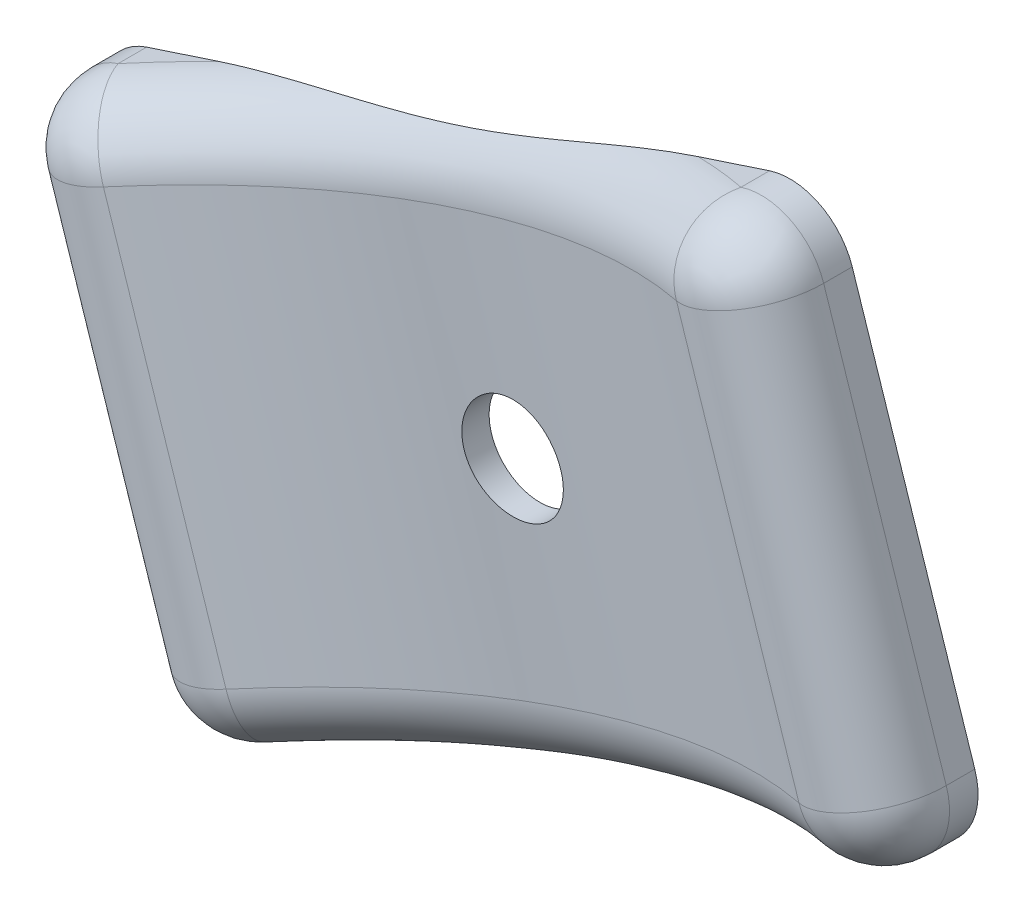
ISO-10303-21;
HEADER;
FILE_DESCRIPTION(('STEP AP214'),'2;1');
FILE_NAME('part.step','',(''),(''),'','','');
FILE_SCHEMA(('AUTOMOTIVE_DESIGN { 1 0 10303 214 1 1 1 1 }'));
ENDSEC;
DATA;
#1=APPLICATION_CONTEXT('core data for automotive mechanical design processes');
#2=APPLICATION_PROTOCOL_DEFINITION('international standard','automotive_design',2000,#1);
#3=PRODUCT_CONTEXT('',#1,'mechanical');
#4=PRODUCT('Part','Part','',(#3));
#5=PRODUCT_RELATED_PRODUCT_CATEGORY('part','',(#4));
#6=PRODUCT_DEFINITION_FORMATION('','',#4);
#7=PRODUCT_DEFINITION_CONTEXT('part definition',#1,'design');
#8=PRODUCT_DEFINITION('design','',#6,#7);
#9=PRODUCT_DEFINITION_SHAPE('','',#8);
#10=(LENGTH_UNIT() NAMED_UNIT(*) SI_UNIT(.MILLI.,.METRE.));
#11=(NAMED_UNIT(*) PLANE_ANGLE_UNIT() SI_UNIT($,.RADIAN.));
#12=(NAMED_UNIT(*) SI_UNIT($,.STERADIAN.) SOLID_ANGLE_UNIT());
#13=UNCERTAINTY_MEASURE_WITH_UNIT(LENGTH_MEASURE(1.E-05),#10,'distance_accuracy_value','');
#14=(GEOMETRIC_REPRESENTATION_CONTEXT(3) GLOBAL_UNCERTAINTY_ASSIGNED_CONTEXT((#13)) GLOBAL_UNIT_ASSIGNED_CONTEXT((#10,
#11,#12)) REPRESENTATION_CONTEXT('',''));
#15=CARTESIAN_POINT('',(0.,0.,0.));
#16=DIRECTION('',(0.,0.,1.));
#17=DIRECTION('',(1.,0.,0.));
#18=AXIS2_PLACEMENT_3D('',#15,#16,#17);
#19=CARTESIAN_POINT('',(-528.62847608422,562.94313302725,74.2702413816953));
#20=DIRECTION('',(-0.311692939950406,0.950182883020463,0.));
#21=DIRECTION('',(-0.950182883020463,-0.311692939950406,0.));
#22=AXIS2_PLACEMENT_3D('',#19,#20,#21);
#23=PLANE('',#22);
#24=DIRECTION('',(0.,0.,-1.));
#25=VECTOR('',#24,1.);
#26=CARTESIAN_POINT('',(-495.443338894726,573.829008955012,74.2702413816945));
#27=LINE('',#26,#25);
#28=CARTESIAN_POINT('',(-495.443338894733,573.82900895501,-5.27355936696949E-13));
#29=VERTEX_POINT('',#28);
#30=CARTESIAN_POINT('',(-495.443338894731,573.829008955012,1.38254680298319));
#31=VERTEX_POINT('',#30);
#32=EDGE_CURVE('E43',#29,#31,#27,.F.);
#33=ORIENTED_EDGE('',*,*,#32,.T.);
#34=CARTESIAN_POINT('',(-510.527492162676,568.880883533306,37.7567413816944));
#35=DIRECTION('',(-0.311692939950406,0.950182883020463,0.));
#36=DIRECTION('',(-0.950182883020463,-0.311692939950406,0.));
#37=AXIS2_PLACEMENT_3D('',#34,#35,#36);
#38=CIRCLE('',#37,39.6875);
#39=CARTESIAN_POINT('',(-498.908572239413,572.692292236459,-5.27355936696949E-13));
#40=VERTEX_POINT('',#39);
#41=EDGE_CURVE('E11',#31,#40,#38,.T.);
#42=ORIENTED_EDGE('',*,*,#41,.T.);
#43=DIRECTION('',(0.950182883020467,0.31169293995041,0.));
#44=VECTOR('',#43,1.);
#45=CARTESIAN_POINT('',(-528.628476084224,562.943133027249,1.55431223447522E-12));
#46=LINE('',#45,#44);
#47=EDGE_CURVE('E146',#40,#29,#46,.T.);
#48=ORIENTED_EDGE('',*,*,#47,.T.);
#49=EDGE_LOOP('',(#33,#42,#48));
#50=FACE_BOUND('',#49,.T.);
#51=ADVANCED_FACE('F34',(#50),#23,.F.);
#52=CARTESIAN_POINT('',(-536.545476758956,587.077778255965,74.2702413816951));
#53=DIRECTION('',(0.311692939950404,-0.950182883020462,0.));
#54=DIRECTION('',(0.950182883020462,0.311692939950404,0.));
#55=AXIS2_PLACEMENT_3D('',#52,#53,#54);
#56=PLANE('',#55);
#57=DIRECTION('',(-0.950182883020462,-0.311692939950404,0.));
#58=VECTOR('',#57,1.);
#59=CARTESIAN_POINT('',(-536.545476758966,587.077778255967,5.27355936696949E-13));
#60=LINE('',#59,#58);
#61=CARTESIAN_POINT('',(-503.36033956947,597.963654183732,0.));
#62=VERTEX_POINT('',#61);
#63=CARTESIAN_POINT('',(-506.825572914159,596.826937465177,4.9960036108132E-13));
#64=VERTEX_POINT('',#63);
#65=EDGE_CURVE('E147',#62,#64,#60,.T.);
#66=ORIENTED_EDGE('',*,*,#65,.T.);
#67=CARTESIAN_POINT('',(-518.444492837414,593.015528762026,37.7567413816942));
#68=DIRECTION('',(0.311692939950404,-0.950182883020462,0.));
#69=DIRECTION('',(0.950182883020462,0.311692939950404,0.));
#70=AXIS2_PLACEMENT_3D('',#67,#68,#69);
#71=CIRCLE('',#70,39.6875);
#72=CARTESIAN_POINT('',(-503.36033956947,597.963654183732,1.38254680298366));
#73=VERTEX_POINT('',#72);
#74=EDGE_CURVE('E156',#64,#73,#71,.T.);
#75=ORIENTED_EDGE('',*,*,#74,.T.);
#76=DIRECTION('',(0.,0.,-1.));
#77=VECTOR('',#76,1.);
#78=CARTESIAN_POINT('',(-503.360339569464,597.96365418373,74.2702413816962));
#79=LINE('',#78,#77);
#80=EDGE_CURVE('E352',#73,#62,#79,.T.);
#81=ORIENTED_EDGE('',*,*,#80,.T.);
#82=EDGE_LOOP('',(#66,#75,#81));
#83=FACE_BOUND('',#82,.T.);
#84=ADVANCED_FACE('F208',(#83),#56,.F.);
#85=CARTESIAN_POINT('',(0.,0.,0.));
#86=DIRECTION('',(0.,0.,-1.));
#87=DIRECTION('',(-1.00000000000001,0.,0.));
#88=AXIS2_PLACEMENT_3D('',#85,#86,#87);
#89=PLANE('',#88);
#90=CARTESIAN_POINT('',(-514.485992500057,580.948206147669,0.));
#91=DIRECTION('',(0.,0.,-1.));
#92=DIRECTION('',(-1.00000000000001,0.,0.));
#93=AXIS2_PLACEMENT_3D('',#90,#91,#92);
#94=CIRCLE('',#93,2.45744999999997);
#95=CARTESIAN_POINT('',(-516.943442500057,580.948206147669,0.));
#96=VERTEX_POINT('',#95);
#97=EDGE_CURVE('E270',#96,#96,#94,.T.);
#98=ORIENTED_EDGE('',*,*,#97,.F.);
#99=EDGE_LOOP('',(#98));
#100=FACE_BOUND('',#99,.T.);
#101=CARTESIAN_POINT('',(-530.063412760688,589.204120058872,1.69309011255336E-12));
#102=VERTEX_POINT('',#101);
#103=CARTESIAN_POINT('',(-533.528646105373,588.06740334031,5.27355936696949E-13));
#104=VERTEX_POINT('',#103);
#105=EDGE_CURVE('E278',#102,#104,#60,.T.);
#106=ORIENTED_EDGE('',*,*,#105,.F.);
#107=CARTESIAN_POINT('',(-530.063412760688,589.204120058872,1.69309011255336E-12));
#108=CARTESIAN_POINT('',(-529.811419203469,589.28676405944,6.0595892845147E-13));
#109=CARTESIAN_POINT('',(-529.55847474358,589.366438377945,1.61887063631748E-13));
#110=CARTESIAN_POINT('',(-529.051089031499,589.520739870902,-1.6186285121665E-13));
#111=CARTESIAN_POINT('',(-528.796648008843,589.59536779848,0.));
#112=CARTESIAN_POINT('',(-528.286779499595,589.740441434673,0.));
#113=CARTESIAN_POINT('',(-528.031352840859,589.810890072637,0.));
#114=CARTESIAN_POINT('',(-527.519605430863,589.94849307235,0.));
#115=CARTESIAN_POINT('',(-527.263284643548,590.015647299575,0.));
#116=CARTESIAN_POINT('',(-526.493126826157,590.213432288535,0.));
#117=CARTESIAN_POINT('',(-525.978333471018,590.340318969917,-2.93010217297221E-13));
#118=CARTESIAN_POINT('',(-524.947716549418,590.590296417725,2.93083988407288E-13));
#119=CARTESIAN_POINT('',(-524.431892756213,590.713386220418,1.12677005579328E-12));
#120=CARTESIAN_POINT('',(-523.254654412827,590.996989692707,1.34249259460469E-12));
#121=CARTESIAN_POINT('',(-522.593404552662,591.158224045594,2.46220362550343E-13));
#122=CARTESIAN_POINT('',(-521.604550157556,591.411729553421,-1.2308911635631E-13));
#123=CARTESIAN_POINT('',(-521.27546346644,591.498165821322,0.));
#124=CARTESIAN_POINT('',(-520.618672225304,591.67615125562,0.));
#125=CARTESIAN_POINT('',(-520.290967667433,591.767700392934,0.));
#126=CARTESIAN_POINT('',(-519.637374558129,591.956855303768,0.));
#127=CARTESIAN_POINT('',(-519.311485665971,592.054459896139,0.));
#128=CARTESIAN_POINT('',(-518.66176422105,592.256293457673,0.));
#129=CARTESIAN_POINT('',(-518.337931661631,592.36052240538,0.));
#130=CARTESIAN_POINT('',(-517.692500883797,592.57569059961,0.));
#131=CARTESIAN_POINT('',(-517.370902686805,592.686629910371,-1.58268218568464E-13));
#132=CARTESIAN_POINT('',(-516.729957411634,592.914823260577,1.5826895769808E-13));
#133=CARTESIAN_POINT('',(-516.410610344203,593.03207733015,5.90081560361208E-13));
#134=CARTESIAN_POINT('',(-515.704518179709,593.298296812364,6.97217452041519E-13));
#135=CARTESIAN_POINT('',(-515.318277601291,593.44859733588,1.86833486482486E-13));
#136=CARTESIAN_POINT('',(-514.548242459317,593.7553187587,-1.86836717686535E-13));
#137=CARTESIAN_POINT('',(-514.164447938427,593.911739764427,0.));
#138=CARTESIAN_POINT('',(-513.398314540719,594.228252991844,0.));
#139=CARTESIAN_POINT('',(-513.015975900963,594.388345783912,0.));
#140=CARTESIAN_POINT('',(-512.251712954135,594.709539161855,0.));
#141=CARTESIAN_POINT('',(-511.869788658693,594.870639775199,0.));
#142=CARTESIAN_POINT('',(-511.103504660287,595.191843463879,0.));
#143=CARTESIAN_POINT('',(-510.719141708106,595.351938846712,0.));
#144=CARTESIAN_POINT('',(-509.948578936939,595.667550585268,0.));
#145=CARTESIAN_POINT('',(-509.562379324668,595.823067442769,0.));
#146=CARTESIAN_POINT('',(-508.786890668311,596.126603271921,0.));
#147=CARTESIAN_POINT('',(-508.397600801916,596.274620164825,0.));
#148=CARTESIAN_POINT('',(-507.810613747059,596.488525286932,0.));
#149=CARTESIAN_POINT('',(-507.614402526421,596.558487008407,0.));
#150=CARTESIAN_POINT('',(-507.2208559766,596.695223130425,0.));
#151=CARTESIAN_POINT('',(-507.023520556578,596.761997269188,1.8414586612374E-13));
#152=CARTESIAN_POINT('',(-506.825572914158,596.826937465177,4.9960036108132E-13));
#153=B_SPLINE_CURVE_WITH_KNOTS('',3,(#107,#108,#109,#110,#111,#112,#113,#114,#115,#116,#117,
#118,#119,#120,#121,#122,#123,#124,#125,#126,#127,#128,#129,#130,#131,#132,#133,#134,#135,#136,
#137,#138,#139,#140,#141,#142,#143,#144,#145,#146,#147,#148,#149,#150,#151,#152),.UNSPECIFIED.,
.F.,.F.,(4,2,2,2,2,2,2,2,2,2,2,2,2,2,2,2,2,2,2,2,2,2,4),(0.,0.795548733611856,1.59097847593355,
2.38584393278886,3.18074182012739,4.77128195669194,6.3622225408555,8.40399702817783,
9.42470953580555,10.4454162380577,11.465924468109,12.4864293929644,13.5069440885456,
14.527463653473,15.7707493084118,17.0140565909677,18.25755833595,19.5010941237146,
20.7501959473358,21.9991603635233,23.2484690792019,23.8733773206907,24.4983367945743),.UNSPECIFIED.);
#154=EDGE_CURVE('E169',#102,#64,#153,.T.);
#155=ORIENTED_EDGE('',*,*,#154,.T.);
#156=ORIENTED_EDGE('',*,*,#65,.F.);
#157=CARTESIAN_POINT('',(-502.37071448513,594.946823530142,0.));
#158=DIRECTION('',(0.,0.,-1.));
#159=DIRECTION('',(-1.00000000000001,0.,0.));
#160=AXIS2_PLACEMENT_3D('',#157,#158,#159);
#161=CIRCLE('',#160,3.175);
#162=CARTESIAN_POINT('',(-499.35388383154,595.936448614483,0.));
#163=VERTEX_POINT('',#162);
#164=EDGE_CURVE('E152',#62,#163,#161,.T.);
#165=ORIENTED_EDGE('',*,*,#164,.T.);
#166=DIRECTION('',(-0.311692939950411,0.950182883020467,0.));
#167=VECTOR('',#166,1.);
#168=CARTESIAN_POINT('',(-500.343508915884,598.953279268079,0.));
#169=LINE('',#168,#167);
#170=CARTESIAN_POINT('',(-493.416133325488,577.83546469295,-5.27355936696949E-13));
#171=VERTEX_POINT('',#170);
#172=EDGE_CURVE('E227',#171,#163,#169,.T.);
#173=ORIENTED_EDGE('',*,*,#172,.F.);
#174=CARTESIAN_POINT('',(-496.432963979074,576.845839608609,-5.27355936696949E-13));
#175=DIRECTION('',(0.,0.,-1.));
#176=DIRECTION('',(-1.00000000000001,0.,0.));
#177=AXIS2_PLACEMENT_3D('',#174,#175,#176);
#178=CIRCLE('',#177,3.175);
#179=EDGE_CURVE('E154',#171,#29,#178,.T.);
#180=ORIENTED_EDGE('',*,*,#179,.T.);
#181=ORIENTED_EDGE('',*,*,#47,.F.);
#182=CARTESIAN_POINT('',(-498.908572239413,572.692292236459,-4.71844785465692E-13));
#183=CARTESIAN_POINT('',(-499.16056579663,572.609648235885,-1.69453568996889E-13));
#184=CARTESIAN_POINT('',(-499.413510256519,572.529973917378,0.));
#185=CARTESIAN_POINT('',(-499.9208959686,572.375672424418,0.));
#186=CARTESIAN_POINT('',(-500.175336991256,572.301044496841,0.));
#187=CARTESIAN_POINT('',(-500.685205500506,572.155970860648,0.));
#188=CARTESIAN_POINT('',(-500.940632159242,572.085522222684,0.));
#189=CARTESIAN_POINT('',(-501.452379569239,571.947919222971,0.));
#190=CARTESIAN_POINT('',(-501.708700356554,571.880764995745,0.));
#191=CARTESIAN_POINT('',(-502.478858173946,571.682980006786,0.));
#192=CARTESIAN_POINT('',(-502.993651529085,571.556093325403,0.));
#193=CARTESIAN_POINT('',(-504.024268450687,571.306115877596,0.));
#194=CARTESIAN_POINT('',(-504.540092243893,571.183026074905,0.));
#195=CARTESIAN_POINT('',(-505.71733058728,570.899422602616,0.));
#196=CARTESIAN_POINT('',(-506.378580447445,570.738188249727,0.));
#197=CARTESIAN_POINT('',(-507.36743484255,570.484682741899,0.));
#198=CARTESIAN_POINT('',(-507.696521533666,570.398246473997,0.));
#199=CARTESIAN_POINT('',(-508.353312774803,570.220261039699,0.));
#200=CARTESIAN_POINT('',(-508.681017332674,570.128711902386,0.));
#201=CARTESIAN_POINT('',(-509.334610441978,569.939556991551,0.));
#202=CARTESIAN_POINT('',(-509.660499334135,569.841952399179,0.));
#203=CARTESIAN_POINT('',(-510.310220779056,569.640118837646,0.));
#204=CARTESIAN_POINT('',(-510.634053338476,569.53588988994,0.));
#205=CARTESIAN_POINT('',(-511.279484116309,569.320721695708,0.));
#206=CARTESIAN_POINT('',(-511.6010823133,569.209782384944,0.));
#207=CARTESIAN_POINT('',(-512.242027588474,568.981589034744,0.));
#208=CARTESIAN_POINT('',(-512.561374655908,568.864334965179,0.));
#209=CARTESIAN_POINT('',(-513.267466820402,568.598115482967,0.));
#210=CARTESIAN_POINT('',(-513.653707398815,568.447814959442,0.));
#211=CARTESIAN_POINT('',(-514.423742540786,568.141093536614,0.));
#212=CARTESIAN_POINT('',(-514.807537061677,567.98467253089,0.));
#213=CARTESIAN_POINT('',(-515.573670459385,567.668159303475,0.));
#214=CARTESIAN_POINT('',(-515.956009099141,567.508066511406,0.));
#215=CARTESIAN_POINT('',(-516.720272045968,567.186873133463,0.));
#216=CARTESIAN_POINT('',(-517.10219634141,567.025772520119,0.));
#217=CARTESIAN_POINT('',(-517.868480339817,566.704568831439,0.));
#218=CARTESIAN_POINT('',(-518.252843291997,566.544473448607,0.));
#219=CARTESIAN_POINT('',(-519.023406063164,566.228861710051,0.));
#220=CARTESIAN_POINT('',(-519.409605675435,566.073344852549,0.));
#221=CARTESIAN_POINT('',(-520.185094331792,565.769809023398,0.));
#222=CARTESIAN_POINT('',(-520.574384198187,565.621792130495,0.));
#223=CARTESIAN_POINT('',(-521.161371253044,565.407887008387,0.));
#224=CARTESIAN_POINT('',(-521.357582473682,565.337925286911,-1.03646438541255E-13));
#225=CARTESIAN_POINT('',(-521.751129023503,565.201189164896,1.03654936072903E-13));
#226=CARTESIAN_POINT('',(-521.948464443527,565.134415026136,3.78470736313441E-13));
#227=CARTESIAN_POINT('',(-522.146412085949,565.069474830153,1.02695629777827E-12));
#228=B_SPLINE_CURVE_WITH_KNOTS('',3,(#182,#183,#184,#185,#186,#187,#188,#189,#190,#191,#192,
#193,#194,#195,#196,#197,#198,#199,#200,#201,#202,#203,#204,#205,#206,#207,#208,#209,#210,#211,
#212,#213,#214,#215,#216,#217,#218,#219,#220,#221,#222,#223,#224,#225,#226,#227),.UNSPECIFIED.,
.F.,.F.,(4,2,2,2,2,2,2,2,2,2,2,2,2,2,2,2,2,2,2,2,2,2,4),(0.,0.795548733613184,1.59097847593613,
2.38584393279246,3.18074182013202,4.77128195669859,6.36222254086414,8.40399702818682,
9.42470953581481,10.4454162380672,11.4659244681184,12.486429392974,13.506944088555,
14.5274636534823,15.7707493084202,17.0140565909754,18.2575583359573,19.5010941237214,
20.7501959473422,21.9991603635297,23.248469079208,23.8733773206969,24.4983367945809),.UNSPECIFIED.);
#229=CARTESIAN_POINT('',(-522.146412085949,565.069474830153,1.02695629777827E-12));
#230=VERTEX_POINT('',#229);
#231=EDGE_CURVE('E161',#40,#230,#228,.T.);
#232=ORIENTED_EDGE('',*,*,#231,.T.);
#233=CARTESIAN_POINT('',(-525.61164543063,563.932758111589,1.22124532708767E-12));
#234=VERTEX_POINT('',#233);
#235=EDGE_CURVE('E225',#234,#230,#46,.T.);
#236=ORIENTED_EDGE('',*,*,#235,.F.);
#237=CARTESIAN_POINT('',(-526.601270514974,566.949588765178,1.22124532708767E-12));
#238=DIRECTION('',(0.,0.,-1.));
#239=DIRECTION('',(-1.00000000000001,0.,0.));
#240=AXIS2_PLACEMENT_3D('',#237,#238,#239);
#241=CIRCLE('',#240,3.175);
#242=CARTESIAN_POINT('',(-529.618101168569,565.959963680835,1.55431223447522E-12));
#243=VERTEX_POINT('',#242);
#244=EDGE_CURVE('E145',#234,#243,#241,.T.);
#245=ORIENTED_EDGE('',*,*,#244,.T.);
#246=DIRECTION('',(0.311692939950403,-0.950182883020462,0.));
#247=VECTOR('',#246,1.);
#248=CARTESIAN_POINT('',(-536.545476758966,587.077778255967,5.27355936696949E-13));
#249=LINE('',#248,#247);
#250=CARTESIAN_POINT('',(-535.555851674623,584.060947602378,5.27355936696949E-13));
#251=VERTEX_POINT('',#250);
#252=EDGE_CURVE('E129',#251,#243,#249,.T.);
#253=ORIENTED_EDGE('',*,*,#252,.F.);
#254=CARTESIAN_POINT('',(-532.539021021026,585.050572686724,5.27355936696949E-13));
#255=DIRECTION('',(0.,0.,-1.));
#256=DIRECTION('',(-1.00000000000001,0.,0.));
#257=AXIS2_PLACEMENT_3D('',#254,#255,#256);
#258=CIRCLE('',#257,3.175);
#259=EDGE_CURVE('E141',#251,#104,#258,.T.);
#260=ORIENTED_EDGE('',*,*,#259,.T.);
#261=EDGE_LOOP('',(#106,#155,#156,#165,#173,#180,#181,#232,#236,#245,#253,#260));
#262=FACE_BOUND('',#261,.T.);
#263=ADVANCED_FACE('F140',(#100,#262),#89,.T.);
#264=CARTESIAN_POINT('',(-500.343508915881,598.953279268078,74.2702413816962));
#265=DIRECTION('',(-0.950182883020467,-0.311692939950411,0.));
#266=DIRECTION('',(0.311692939950411,-0.950182883020467,0.));
#267=AXIS2_PLACEMENT_3D('',#264,#265,#266);
#268=PLANE('',#267);
#269=DIRECTION('',(-0.311692939950411,0.950182883020467,0.));
#270=VECTOR('',#269,1.);
#271=CARTESIAN_POINT('',(-500.343508915884,598.953279268079,1.38254680298386));
#272=LINE('',#271,#270);
#273=CARTESIAN_POINT('',(-499.353883831537,595.936448614483,1.38254680298386));
#274=VERTEX_POINT('',#273);
#275=CARTESIAN_POINT('',(-493.416133325486,577.83546469295,1.38254680298336));
#276=VERTEX_POINT('',#275);
#277=EDGE_CURVE('E361',#274,#276,#272,.F.);
#278=ORIENTED_EDGE('',*,*,#277,.T.);
#279=DIRECTION('',(0.,0.,-1.));
#280=VECTOR('',#279,1.);
#281=CARTESIAN_POINT('',(-493.416133325481,577.835464692952,74.2702413816945));
#282=LINE('',#281,#280);
#283=EDGE_CURVE('E239',#276,#171,#282,.T.);
#284=ORIENTED_EDGE('',*,*,#283,.T.);
#285=ORIENTED_EDGE('',*,*,#172,.T.);
#286=DIRECTION('',(0.,0.,-1.));
#287=VECTOR('',#286,1.);
#288=CARTESIAN_POINT('',(-499.353883831535,595.936448614484,74.2702413816962));
#289=LINE('',#288,#287);
#290=EDGE_CURVE('E363',#163,#274,#289,.F.);
#291=ORIENTED_EDGE('',*,*,#290,.T.);
#292=EDGE_LOOP('',(#278,#284,#285,#291));
#293=FACE_BOUND('',#292,.T.);
#294=ADVANCED_FACE('F219',(#293),#268,.F.);
#295=ORIENTED_EDGE('',*,*,#235,.T.);
#296=CARTESIAN_POINT('',(-510.527492162676,568.880883533306,37.7567413816944));
#297=DIRECTION('',(-0.311692939950406,0.950182883020463,0.));
#298=DIRECTION('',(-0.950182883020463,-0.311692939950406,0.));
#299=AXIS2_PLACEMENT_3D('',#296,#297,#298);
#300=CIRCLE('',#299,39.6875);
#301=CARTESIAN_POINT('',(-525.611645430629,563.932758111589,1.38254680298616));
#302=VERTEX_POINT('',#301);
#303=EDGE_CURVE('E57',#230,#302,#300,.T.);
#304=ORIENTED_EDGE('',*,*,#303,.T.);
#305=DIRECTION('',(0.,0.,-1.));
#306=VECTOR('',#305,1.);
#307=CARTESIAN_POINT('',(-525.611645430627,563.932758111586,74.2702413816953));
#308=LINE('',#307,#306);
#309=EDGE_CURVE('E226',#302,#234,#308,.T.);
#310=ORIENTED_EDGE('',*,*,#309,.T.);
#311=EDGE_LOOP('',(#295,#304,#310));
#312=FACE_BOUND('',#311,.T.);
#313=ADVANCED_FACE('F210',(#312),#23,.F.);
#314=CARTESIAN_POINT('',(-536.545476758956,587.077778255965,74.2702413816951));
#315=DIRECTION('',(0.950182883020462,0.311692939950403,0.));
#316=DIRECTION('',(-0.311692939950403,0.950182883020462,0.));
#317=AXIS2_PLACEMENT_3D('',#314,#315,#316);
#318=PLANE('',#317);
#319=DIRECTION('',(-0.311692939950403,0.950182883020462,0.));
#320=VECTOR('',#319,1.);
#321=CARTESIAN_POINT('',(-536.545476758967,587.07777825597,1.38254680298569));
#322=LINE('',#321,#320);
#323=CARTESIAN_POINT('',(-529.618101168569,565.959963680835,1.38254680298672));
#324=VERTEX_POINT('',#323);
#325=CARTESIAN_POINT('',(-535.555851674623,584.060947602378,1.38254680298569));
#326=VERTEX_POINT('',#325);
#327=EDGE_CURVE('E132',#324,#326,#322,.T.);
#328=ORIENTED_EDGE('',*,*,#327,.T.);
#329=DIRECTION('',(0.,0.,-1.));
#330=VECTOR('',#329,1.);
#331=CARTESIAN_POINT('',(-535.55585167462,584.060947602378,74.2702413816951));
#332=LINE('',#331,#330);
#333=EDGE_CURVE('E126',#326,#251,#332,.T.);
#334=ORIENTED_EDGE('',*,*,#333,.T.);
#335=ORIENTED_EDGE('',*,*,#252,.T.);
#336=DIRECTION('',(0.,0.,-1.));
#337=VECTOR('',#336,1.);
#338=CARTESIAN_POINT('',(-529.618101168561,565.959963680835,74.2702413816953));
#339=LINE('',#338,#337);
#340=EDGE_CURVE('E283',#243,#324,#339,.F.);
#341=ORIENTED_EDGE('',*,*,#340,.T.);
#342=EDGE_LOOP('',(#328,#334,#335,#341));
#343=FACE_BOUND('',#342,.T.);
#344=ADVANCED_FACE('F128',(#343),#318,.F.);
#345=DIRECTION('',(0.,0.,-1.));
#346=VECTOR('',#345,1.);
#347=CARTESIAN_POINT('',(-533.528646105369,588.067403340309,74.2702413816935));
#348=LINE('',#347,#346);
#349=CARTESIAN_POINT('',(-533.528646105371,588.067403340309,1.38254680298552));
#350=VERTEX_POINT('',#349);
#351=EDGE_CURVE('E151',#104,#350,#348,.F.);
#352=ORIENTED_EDGE('',*,*,#351,.T.);
#353=CARTESIAN_POINT('',(-518.444492837414,593.015528762026,37.7567413816942));
#354=DIRECTION('',(0.311692939950404,-0.950182883020462,0.));
#355=DIRECTION('',(0.950182883020462,0.311692939950404,0.));
#356=AXIS2_PLACEMENT_3D('',#353,#354,#355);
#357=CIRCLE('',#356,39.6875);
#358=EDGE_CURVE('E319',#350,#102,#357,.T.);
#359=ORIENTED_EDGE('',*,*,#358,.T.);
#360=ORIENTED_EDGE('',*,*,#105,.T.);
#361=EDGE_LOOP('',(#352,#359,#360));
#362=FACE_BOUND('',#361,.T.);
#363=ADVANCED_FACE('F216',(#362),#56,.F.);
#364=CARTESIAN_POINT('',(-443.232986427391,363.736399089187,37.7567413816977));
#365=DIRECTION('',(-0.311692939950405,0.950182883020465,0.));
#366=DIRECTION('',(0.950182883020465,0.311692939950405,0.));
#367=AXIS2_PLACEMENT_3D('',#364,#365,#366);
#368=CYLINDRICAL_SURFACE('',#367,36.5125);
#369=CARTESIAN_POINT('',(-517.454867753075,589.998698108429,37.7567413816945));
#370=DIRECTION('',(0.311692939950404,-0.950182883020462,0.));
#371=DIRECTION('',(0.950182883020462,0.311692939950404,0.));
#372=AXIS2_PLACEMENT_3D('',#369,#370,#371);
#373=CIRCLE('',#372,36.5125);
#374=CARTESIAN_POINT('',(-503.577446746568,594.550973496411,4.29248236928076));
#375=VERTEX_POINT('',#374);
#376=CARTESIAN_POINT('',(-531.332288759591,585.446422720454,4.29248236928112));
#377=VERTEX_POINT('',#376);
#378=EDGE_CURVE('E307',#375,#377,#373,.F.);
#379=ORIENTED_EDGE('',*,*,#378,.T.);
#380=DIRECTION('',(-0.311692939950405,0.950182883020465,0.));
#381=VECTOR('',#380,1.);
#382=CARTESIAN_POINT('',(-457.110407433903,359.184123701211,4.29248236928273));
#383=LINE('',#382,#381);
#384=CARTESIAN_POINT('',(-525.394538253542,567.345438798919,4.29248236928098));
#385=VERTEX_POINT('',#384);
#386=EDGE_CURVE('E310',#377,#385,#383,.F.);
#387=ORIENTED_EDGE('',*,*,#386,.T.);
#388=CARTESIAN_POINT('',(-511.517117247018,571.897714186894,37.7567413816944));
#389=DIRECTION('',(-0.311692939950406,0.950182883020463,0.));
#390=DIRECTION('',(-0.950182883020463,-0.311692939950406,0.));
#391=AXIS2_PLACEMENT_3D('',#388,#389,#390);
#392=CIRCLE('',#391,36.5125);
#393=CARTESIAN_POINT('',(-497.63969624051,576.449989574865,4.29248236928123));
#394=VERTEX_POINT('',#393);
#395=EDGE_CURVE('E136',#385,#394,#392,.F.);
#396=ORIENTED_EDGE('',*,*,#395,.T.);
#397=DIRECTION('',(-0.311692939950405,0.950182883020465,0.));
#398=VECTOR('',#397,1.);
#399=CARTESIAN_POINT('',(-429.355565420878,368.288674477166,4.29248236928112));
#400=LINE('',#399,#398);
#401=EDGE_CURVE('E312',#394,#375,#400,.T.);
#402=ORIENTED_EDGE('',*,*,#401,.T.);
#403=EDGE_LOOP('',(#379,#387,#396,#402));
#404=FACE_BOUND('',#403,.T.);
#405=CARTESIAN_POINT('',(-516.943442500052,580.948206147666,1.31898204463818));
#406=CARTESIAN_POINT('',(-516.943436462238,581.086280128444,1.31622337745073));
#407=CARTESIAN_POINT('',(-516.931766955246,581.224438197499,1.31282615127622));
#408=CARTESIAN_POINT('',(-516.885391367775,581.496921099854,1.30513494053353));
#409=CARTESIAN_POINT('',(-516.850658092104,581.631241212452,1.30083990142821));
#410=CARTESIAN_POINT('',(-516.759153346013,581.892072418116,1.29184304621809));
#411=CARTESIAN_POINT('',(-516.702393323885,582.018587528269,1.2871414424082));
#412=CARTESIAN_POINT('',(-516.568454515422,582.260264755703,1.2778602910636));
#413=CARTESIAN_POINT('',(-516.491280635176,582.375429591695,1.27328071449262));
#414=CARTESIAN_POINT('',(-516.318616196164,582.591271744558,1.26475430325269));
#415=CARTESIAN_POINT('',(-516.223111502348,582.691937775731,1.26080796121628));
#416=CARTESIAN_POINT('',(-516.016521206682,582.875812213203,1.2539971715096));
#417=CARTESIAN_POINT('',(-515.905435172489,582.959020134922,1.2511327538682));
#418=CARTESIAN_POINT('',(-515.671009303191,583.105489195054,1.24681251412389));
#419=CARTESIAN_POINT('',(-515.547687385129,583.1687789489,1.24535466499239));
#420=CARTESIAN_POINT('',(-515.292164358795,583.273765310798,1.24400474561387));
#421=CARTESIAN_POINT('',(-515.159963368459,583.315462205588,1.24411265457409));
#422=CARTESIAN_POINT('',(-514.890679866993,583.376024487019,1.24588048542796));
#423=CARTESIAN_POINT('',(-514.753606067743,583.394928699628,1.24753775949432));
#424=CARTESIAN_POINT('',(-514.478252474929,583.409508427745,1.25221429954704));
#425=CARTESIAN_POINT('',(-514.339972677945,583.405183877352,1.25523356939733));
#426=CARTESIAN_POINT('',(-514.066025898861,583.373430931947,1.26229776166107));
#427=CARTESIAN_POINT('',(-513.930360723454,583.345987108566,1.26634336772731));
#428=CARTESIAN_POINT('',(-513.665563056324,583.268761496097,1.27500546665702));
#429=CARTESIAN_POINT('',(-513.536430660682,583.218979378572,1.27962196791353));
#430=CARTESIAN_POINT('',(-513.288084313322,583.098362069357,1.28891755078248));
#431=CARTESIAN_POINT('',(-513.168890773009,583.027484854767,1.29359673933461));
#432=CARTESIAN_POINT('',(-512.944083459417,582.866714258328,1.30248130506079));
#433=CARTESIAN_POINT('',(-512.838469699996,582.776820857072,1.30668668175127));
#434=CARTESIAN_POINT('',(-512.643797907115,582.580532715978,1.31414944322208));
#435=CARTESIAN_POINT('',(-512.554743583247,582.474134288503,1.31740661568087));
#436=CARTESIAN_POINT('',(-512.395763214968,582.247867340347,1.3226024059001));
#437=CARTESIAN_POINT('',(-512.325836918233,582.127998997381,1.32454104105427));
#438=CARTESIAN_POINT('',(-512.207228241756,581.878444750944,1.32687723697683));
#439=CARTESIAN_POINT('',(-512.158505421905,581.748778094761,1.3272777428492));
#440=CARTESIAN_POINT('',(-512.08349727712,581.48311517812,1.32650043684738));
#441=CARTESIAN_POINT('',(-512.057211793439,581.347118962452,1.32532263614002));
#442=CARTESIAN_POINT('',(-512.027834473832,581.072812054894,1.32152428174242));
#443=CARTESIAN_POINT('',(-512.024717990961,580.934503979417,1.31890526439112));
#444=CARTESIAN_POINT('',(-512.041688764264,580.659345771512,1.31252112067334));
#445=CARTESIAN_POINT('',(-512.061776252284,580.522495653665,1.30875598285545));
#446=CARTESIAN_POINT('',(-512.1246216301,580.253917539479,1.3004972103714));
#447=CARTESIAN_POINT('',(-512.16741235336,580.122197258827,1.29600252718626));
#448=CARTESIAN_POINT('',(-512.274469975676,579.867801702657,1.2867942151071));
#449=CARTESIAN_POINT('',(-512.338737119498,579.745126530247,1.28208058371824));
#450=CARTESIAN_POINT('',(-512.487063903027,579.512081247092,1.27295603768139));
#451=CARTESIAN_POINT('',(-512.571157024474,579.401732422631,1.26854565160366));
#452=CARTESIAN_POINT('',(-512.756702223144,579.19671239106,1.26053337742809));
#453=CARTESIAN_POINT('',(-512.858154221376,579.102041112613,1.25693148565137));
#454=CARTESIAN_POINT('',(-513.075469238234,578.931134046717,1.2509444877588));
#455=CARTESIAN_POINT('',(-513.19132217596,578.854885471908,1.24855853636463));
#456=CARTESIAN_POINT('',(-513.434202845855,578.722919689149,1.24526881728087));
#457=CARTESIAN_POINT('',(-513.561230413437,578.667202178868,1.24436502776486));
#458=CARTESIAN_POINT('',(-513.822577021242,578.577980805192,1.24414181550241));
#459=CARTESIAN_POINT('',(-513.956880961611,578.544432712564,1.24481922585416));
#460=CARTESIAN_POINT('',(-514.22919579135,578.500321079019,1.24767560299854));
#461=CARTESIAN_POINT('',(-514.367206683254,578.489757553813,1.24985457081754));
#462=CARTESIAN_POINT('',(-514.642994087967,578.491903316926,1.25546866806305));
#463=CARTESIAN_POINT('',(-514.780770640204,578.504608199282,1.25890355957704));
#464=CARTESIAN_POINT('',(-515.052226097389,578.552909511758,1.26664432806625));
#465=CARTESIAN_POINT('',(-515.185904941643,578.588506280773,1.27095021793521));
#466=CARTESIAN_POINT('',(-515.445652772794,578.681669910904,1.27995931084208));
#467=CARTESIAN_POINT('',(-515.571706539554,578.739279136198,1.28466326630299));
#468=CARTESIAN_POINT('',(-515.812360771871,578.874832266687,1.29393209289219));
#469=CARTESIAN_POINT('',(-515.926961582364,578.952775559212,1.29849696820637));
#470=CARTESIAN_POINT('',(-516.141575660902,579.126883373188,1.30697768101051));
#471=CARTESIAN_POINT('',(-516.24157508501,579.223064990826,1.31089290302153));
#472=CARTESIAN_POINT('',(-516.424032524906,579.430910870933,1.31762665972635));
#473=CARTESIAN_POINT('',(-516.506486538562,579.542578656246,1.32044494432846));
#474=CARTESIAN_POINT('',(-516.651390383537,579.778071454816,1.32466182641349));
#475=CARTESIAN_POINT('',(-516.713860200671,579.901884159184,1.32606184533301));
#476=CARTESIAN_POINT('',(-516.817067483273,580.158150264018,1.32728574634446));
#477=CARTESIAN_POINT('',(-516.857830279582,580.290593389726,1.32711146983526));
#478=CARTESIAN_POINT('',(-516.905879694228,580.511238446438,1.32556143463884));
#479=CARTESIAN_POINT('',(-516.919948508872,580.598026298223,1.32464533366967));
#480=CARTESIAN_POINT('',(-516.93873182119,580.772600145016,1.32223294370071));
#481=CARTESIAN_POINT('',(-516.943446340318,580.860386137735,1.32073665603153));
#482=CARTESIAN_POINT('',(-516.943442500052,580.948206147666,1.31898204463818));
#483=B_SPLINE_CURVE_WITH_KNOTS('',3,(#405,#406,#407,#408,#409,#410,#411,#412,#413,#414,#415,
#416,#417,#418,#419,#420,#421,#422,#423,#424,#425,#426,#427,#428,#429,#430,#431,#432,#433,#434,
#435,#436,#437,#438,#439,#440,#441,#442,#443,#444,#445,#446,#447,#448,#449,#450,#451,#452,#453,
#454,#455,#456,#457,#458,#459,#460,#461,#462,#463,#464,#465,#466,#467,#468,#469,#470,#471,#472,
#473,#474,#475,#476,#477,#478,#479,#480,#481,#482),.UNSPECIFIED.,.T.,.F.,(4,2,2,2,2,2,2,2,2,2,2,
2,2,2,2,2,2,2,2,2,2,2,2,2,2,2,2,2,2,2,2,2,2,2,2,2,2,2,4),(0.,0.413983740173897,
0.828456490073464,1.24271410770612,1.65687225656613,2.07135105884246,2.48584136414974,
2.89973344460573,3.31362002871095,3.72680058118057,4.13998230583962,4.55343998095038,
4.96690373525377,5.38119671460161,5.79549011677286,6.20987621613595,6.62425684893889,
7.0378436575231,7.45142753991392,7.86457139298063,8.27771937409083,8.69146648583955,
9.10521831322845,9.51967394632405,9.93412769348135,10.3482929328346,10.7624520731066,
11.1757824278357,11.5891130650951,12.0023654447157,12.4156239423347,12.8296818174951,
13.2437272184292,13.6581626719289,14.0726925576554,14.4868065744444,14.9004362791788,
15.1637454077244,15.4270539323909),.UNSPECIFIED.);
#484=CARTESIAN_POINT('',(-516.943442500052,580.948206147666,1.31898204463818));
#485=VERTEX_POINT('',#484);
#486=EDGE_CURVE('E273',#485,#485,#483,.T.);
#487=ORIENTED_EDGE('',*,*,#486,.T.);
#488=EDGE_LOOP('',(#487));
#489=FACE_BOUND('',#488,.T.);
#490=ADVANCED_FACE('F290',(#404,#489),#368,.F.);
#491=CARTESIAN_POINT('',(-514.485992500057,580.948206147669,0.));
#492=DIRECTION('',(0.,0.,-1.));
#493=DIRECTION('',(-1.00000000000001,0.,0.));
#494=AXIS2_PLACEMENT_3D('',#491,#492,#493);
#495=CYLINDRICAL_SURFACE('',#494,2.45744999999997);
#496=ORIENTED_EDGE('',*,*,#97,.T.);
#497=EDGE_LOOP('',(#496));
#498=FACE_BOUND('',#497,.T.);
#499=ORIENTED_EDGE('',*,*,#486,.F.);
#500=EDGE_LOOP('',(#499));
#501=FACE_BOUND('',#500,.T.);
#502=ADVANCED_FACE('F204',(#498,#501),#495,.F.);
#503=CARTESIAN_POINT('',(-496.432963979067,576.845839608608,74.2702413816945));
#504=DIRECTION('',(0.,0.,-1.));
#505=DIRECTION('',(-1.00000000000001,0.,0.));
#506=AXIS2_PLACEMENT_3D('',#503,#504,#505);
#507=CYLINDRICAL_SURFACE('',#506,3.175);
#508=ORIENTED_EDGE('',*,*,#179,.F.);
#509=ORIENTED_EDGE('',*,*,#283,.F.);
#510=CARTESIAN_POINT('',(-496.432963979073,576.845839608608,1.38254680298319));
#511=DIRECTION('',(0.,0.,1.));
#512=DIRECTION('',(1.00000000000001,0.,0.));
#513=AXIS2_PLACEMENT_3D('',#510,#511,#512);
#514=CIRCLE('',#513,3.175);
#515=EDGE_CURVE('E266',#31,#276,#514,.T.);
#516=ORIENTED_EDGE('',*,*,#515,.F.);
#517=ORIENTED_EDGE('',*,*,#32,.F.);
#518=EDGE_LOOP('',(#508,#509,#516,#517));
#519=FACE_BOUND('',#518,.T.);
#520=ADVANCED_FACE('F36',(#519),#507,.T.);
#521=CARTESIAN_POINT('',(-502.370714485127,594.946823530143,74.2702413816962));
#522=DIRECTION('',(0.,0.,-1.));
#523=DIRECTION('',(-1.00000000000001,0.,0.));
#524=AXIS2_PLACEMENT_3D('',#521,#522,#523);
#525=CYLINDRICAL_SURFACE('',#524,3.175);
#526=ORIENTED_EDGE('',*,*,#164,.F.);
#527=ORIENTED_EDGE('',*,*,#80,.F.);
#528=CARTESIAN_POINT('',(-502.37071448513,594.946823530143,1.38254680298386));
#529=DIRECTION('',(0.,0.,1.));
#530=DIRECTION('',(0.,-1.00000000000001,0.));
#531=AXIS2_PLACEMENT_3D('',#528,#529,#530);
#532=CIRCLE('',#531,3.175);
#533=EDGE_CURVE('E264',#274,#73,#532,.T.);
#534=ORIENTED_EDGE('',*,*,#533,.F.);
#535=ORIENTED_EDGE('',*,*,#290,.F.);
#536=EDGE_LOOP('',(#526,#527,#534,#535));
#537=FACE_BOUND('',#536,.T.);
#538=ADVANCED_FACE('F197',(#537),#525,.T.);
#539=CARTESIAN_POINT('',(-428.148833159441,368.684524510903,1.38254680298358));
#540=DIRECTION('',(-0.311692939950405,0.950182883020465,0.));
#541=DIRECTION('',(-0.950182883020465,-0.311692939950405,0.));
#542=AXIS2_PLACEMENT_3D('',#539,#540,#541);
#543=CYLINDRICAL_SURFACE('',#542,3.175);
#544=CARTESIAN_POINT('',(-496.432963979073,576.845839608608,1.38254680298336));
#545=DIRECTION('',(0.311692939950405,-0.950182883020468,0.));
#546=DIRECTION('',(0.950182883020468,0.311692939950405,0.));
#547=AXIS2_PLACEMENT_3D('',#544,#545,#546);
#548=CIRCLE('',#547,3.175);
#549=EDGE_CURVE('E38',#276,#394,#548,.T.);
#550=ORIENTED_EDGE('',*,*,#549,.F.);
#551=ORIENTED_EDGE('',*,*,#277,.F.);
#552=CARTESIAN_POINT('',(-502.370714485129,594.946823530142,1.38254680298386));
#553=DIRECTION('',(-0.311692939950386,0.950182883020477,0.));
#554=DIRECTION('',(-0.950182883020478,-0.311692939950386,0.));
#555=AXIS2_PLACEMENT_3D('',#552,#553,#554);
#556=CIRCLE('',#555,3.175);
#557=EDGE_CURVE('E261',#375,#274,#556,.T.);
#558=ORIENTED_EDGE('',*,*,#557,.F.);
#559=ORIENTED_EDGE('',*,*,#401,.F.);
#560=EDGE_LOOP('',(#550,#551,#558,#559));
#561=FACE_BOUND('',#560,.T.);
#562=ADVANCED_FACE('F194',(#561),#543,.T.);
#563=CARTESIAN_POINT('',(-496.432963979073,576.845839608608,1.38254680298314));
#564=DIRECTION('',(0.,0.,1.));
#565=DIRECTION('',(1.00000000000001,0.,0.));
#566=AXIS2_PLACEMENT_3D('',#563,#564,#565);
#567=SPHERICAL_SURFACE('',#566,3.175);
#568=ORIENTED_EDGE('',*,*,#515,.T.);
#569=ORIENTED_EDGE('',*,*,#549,.T.);
#570=CARTESIAN_POINT('',(-496.432963979074,576.845839608608,1.38254680298336));
#571=DIRECTION('',(0.870856997098599,0.285671298181052,0.399999999999977));
#572=DIRECTION('',(0.417393774074928,0.,-0.908725721746387));
#573=AXIS2_PLACEMENT_3D('',#570,#571,#572);
#574=CIRCLE('',#573,3.175);
#575=EDGE_CURVE('E259',#31,#394,#574,.F.);
#576=ORIENTED_EDGE('',*,*,#575,.F.);
#577=EDGE_LOOP('',(#568,#569,#576));
#578=FACE_BOUND('',#577,.T.);
#579=ADVANCED_FACE('F190',(#578),#567,.T.);
#580=CARTESIAN_POINT('',(-502.37071448513,594.946823530143,1.38254680298364));
#581=DIRECTION('',(0.,0.,1.));
#582=DIRECTION('',(1.00000000000001,0.,0.));
#583=AXIS2_PLACEMENT_3D('',#580,#581,#582);
#584=SPHERICAL_SURFACE('',#583,3.175);
#585=ORIENTED_EDGE('',*,*,#557,.T.);
#586=ORIENTED_EDGE('',*,*,#533,.T.);
#587=CARTESIAN_POINT('',(-502.37071448513,594.946823530143,1.38254680298364));
#588=DIRECTION('',(0.870856997098616,0.285671298181239,0.399999999999805));
#589=DIRECTION('',(0.417393774074773,0.,-0.908725721746458));
#590=AXIS2_PLACEMENT_3D('',#587,#588,#589);
#591=CIRCLE('',#590,3.175);
#592=EDGE_CURVE('E256',#375,#73,#591,.F.);
#593=ORIENTED_EDGE('',*,*,#592,.F.);
#594=EDGE_LOOP('',(#585,#586,#593));
#595=FACE_BOUND('',#594,.T.);
#596=ADVANCED_FACE('F185',(#595),#584,.T.);
#597=CARTESIAN_POINT('',(-511.517117247018,571.897714186894,37.7567413816944));
#598=DIRECTION('',(-0.311692939950406,0.950182883020463,0.));
#599=DIRECTION('',(-0.950182883020463,-0.311692939950406,0.));
#600=AXIS2_PLACEMENT_3D('',#597,#598,#599);
#601=TOROIDAL_SURFACE('',#600,39.6875,3.175);
#602=ORIENTED_EDGE('',*,*,#575,.T.);
#603=ORIENTED_EDGE('',*,*,#395,.F.);
#604=CARTESIAN_POINT('',(-526.601270514974,566.949588765178,1.38254680298616));
#605=DIRECTION('',(-0.87085699709856,-0.285671298181224,0.399999999999959));
#606=DIRECTION('',(0.417393774074926,0.,0.908725721746386));
#607=AXIS2_PLACEMENT_3D('',#604,#605,#606);
#608=CIRCLE('',#607,3.175);
#609=EDGE_CURVE('E235',#302,#385,#608,.T.);
#610=ORIENTED_EDGE('',*,*,#609,.F.);
#611=ORIENTED_EDGE('',*,*,#303,.F.);
#612=ORIENTED_EDGE('',*,*,#231,.F.);
#613=ORIENTED_EDGE('',*,*,#41,.F.);
#614=EDGE_LOOP('',(#602,#603,#610,#611,#612,#613));
#615=FACE_BOUND('',#614,.T.);
#616=ADVANCED_FACE('F179',(#615),#601,.T.);
#617=CARTESIAN_POINT('',(-526.601270514971,566.949588765178,74.2702413816953));
#618=DIRECTION('',(0.,0.,-1.));
#619=DIRECTION('',(-1.00000000000001,0.,0.));
#620=AXIS2_PLACEMENT_3D('',#617,#618,#619);
#621=CYLINDRICAL_SURFACE('',#620,3.175);
#622=ORIENTED_EDGE('',*,*,#244,.F.);
#623=ORIENTED_EDGE('',*,*,#309,.F.);
#624=CARTESIAN_POINT('',(-526.601270514974,566.949588765178,1.38254680298633));
#625=DIRECTION('',(0.,0.,1.));
#626=DIRECTION('',(0.,-1.00000000000001,0.));
#627=AXIS2_PLACEMENT_3D('',#624,#625,#626);
#628=CIRCLE('',#627,3.175);
#629=EDGE_CURVE('E253',#324,#302,#628,.T.);
#630=ORIENTED_EDGE('',*,*,#629,.F.);
#631=ORIENTED_EDGE('',*,*,#340,.F.);
#632=EDGE_LOOP('',(#622,#623,#630,#631));
#633=FACE_BOUND('',#632,.T.);
#634=ADVANCED_FACE('F184',(#633),#621,.T.);
#635=CARTESIAN_POINT('',(-532.53902102102,585.050572686724,74.2702413816935));
#636=DIRECTION('',(0.,0.,-1.));
#637=DIRECTION('',(-1.00000000000001,0.,0.));
#638=AXIS2_PLACEMENT_3D('',#635,#636,#637);
#639=CYLINDRICAL_SURFACE('',#638,3.175);
#640=ORIENTED_EDGE('',*,*,#259,.F.);
#641=ORIENTED_EDGE('',*,*,#333,.F.);
#642=CARTESIAN_POINT('',(-532.539021021025,585.050572686724,1.38254680298552));
#643=DIRECTION('',(0.,0.,1.));
#644=DIRECTION('',(1.00000000000001,0.,0.));
#645=AXIS2_PLACEMENT_3D('',#642,#643,#644);
#646=CIRCLE('',#645,3.175);
#647=EDGE_CURVE('E250',#350,#326,#646,.T.);
#648=ORIENTED_EDGE('',*,*,#647,.F.);
#649=ORIENTED_EDGE('',*,*,#351,.F.);
#650=EDGE_LOOP('',(#640,#641,#648,#649));
#651=FACE_BOUND('',#650,.T.);
#652=ADVANCED_FACE('F150',(#651),#639,.T.);
#653=CARTESIAN_POINT('',(-517.454867753075,589.998698108429,37.7567413816945));
#654=DIRECTION('',(0.311692939950404,-0.950182883020462,0.));
#655=DIRECTION('',(0.950182883020462,0.311692939950404,0.));
#656=AXIS2_PLACEMENT_3D('',#653,#654,#655);
#657=TOROIDAL_SURFACE('',#656,39.6875,3.175);
#658=ORIENTED_EDGE('',*,*,#154,.F.);
#659=ORIENTED_EDGE('',*,*,#358,.F.);
#660=CARTESIAN_POINT('',(-532.539021021022,585.050572686723,1.38254680298563));
#661=DIRECTION('',(-0.870856997098552,-0.285671298181133,0.400000000000039));
#662=DIRECTION('',(0.417393774074997,0.,0.908725721746353));
#663=AXIS2_PLACEMENT_3D('',#660,#661,#662);
#664=CIRCLE('',#663,3.175);
#665=EDGE_CURVE('E247',#377,#350,#664,.T.);
#666=ORIENTED_EDGE('',*,*,#665,.F.);
#667=ORIENTED_EDGE('',*,*,#378,.F.);
#668=ORIENTED_EDGE('',*,*,#592,.T.);
#669=ORIENTED_EDGE('',*,*,#74,.F.);
#670=EDGE_LOOP('',(#658,#659,#666,#667,#668,#669));
#671=FACE_BOUND('',#670,.T.);
#672=ADVANCED_FACE('F318',(#671),#657,.T.);
#673=CARTESIAN_POINT('',(-526.601270514974,566.949588765178,1.38254680298616));
#674=DIRECTION('',(0.,0.,1.));
#675=DIRECTION('',(1.00000000000001,0.,0.));
#676=AXIS2_PLACEMENT_3D('',#673,#674,#675);
#677=SPHERICAL_SURFACE('',#676,3.175);
#678=ORIENTED_EDGE('',*,*,#629,.T.);
#679=ORIENTED_EDGE('',*,*,#609,.T.);
#680=CARTESIAN_POINT('',(-526.601270514974,566.949588765177,1.38254680298633));
#681=DIRECTION('',(0.311692939950395,-0.950182883020465,0.));
#682=DIRECTION('',(0.950182883020465,0.311692939950395,0.));
#683=AXIS2_PLACEMENT_3D('',#680,#681,#682);
#684=CIRCLE('',#683,3.175);
#685=EDGE_CURVE('E245',#324,#385,#684,.F.);
#686=ORIENTED_EDGE('',*,*,#685,.F.);
#687=EDGE_LOOP('',(#678,#679,#686));
#688=FACE_BOUND('',#687,.T.);
#689=ADVANCED_FACE('F328',(#688),#677,.T.);
#690=CARTESIAN_POINT('',(-532.539021021025,585.050572686724,1.38254680298552));
#691=DIRECTION('',(0.,0.,1.));
#692=DIRECTION('',(1.00000000000001,0.,0.));
#693=AXIS2_PLACEMENT_3D('',#690,#691,#692);
#694=SPHERICAL_SURFACE('',#693,3.175);
#695=ORIENTED_EDGE('',*,*,#665,.T.);
#696=ORIENTED_EDGE('',*,*,#647,.T.);
#697=CARTESIAN_POINT('',(-532.539021021025,585.050572686724,1.38254680298569));
#698=DIRECTION('',(-0.311692939950406,0.950182883020462,0.));
#699=DIRECTION('',(-0.950182883020462,-0.311692939950406,0.));
#700=AXIS2_PLACEMENT_3D('',#697,#698,#699);
#701=CIRCLE('',#700,3.175);
#702=EDGE_CURVE('E243',#377,#326,#701,.F.);
#703=ORIENTED_EDGE('',*,*,#702,.F.);
#704=EDGE_LOOP('',(#695,#696,#703));
#705=FACE_BOUND('',#704,.T.);
#706=ADVANCED_FACE('F326',(#705),#694,.T.);
#707=CARTESIAN_POINT('',(-458.317139695339,358.788273667475,1.38254680298507));
#708=DIRECTION('',(-0.311692939950405,0.950182883020465,0.));
#709=DIRECTION('',(-0.950182883020465,-0.311692939950405,0.));
#710=AXIS2_PLACEMENT_3D('',#707,#708,#709);
#711=CYLINDRICAL_SURFACE('',#710,3.175);
#712=ORIENTED_EDGE('',*,*,#685,.T.);
#713=ORIENTED_EDGE('',*,*,#386,.F.);
#714=ORIENTED_EDGE('',*,*,#702,.T.);
#715=ORIENTED_EDGE('',*,*,#327,.F.);
#716=EDGE_LOOP('',(#712,#713,#714,#715));
#717=FACE_BOUND('',#716,.T.);
#718=ADVANCED_FACE('F323',(#717),#711,.T.);
#719=CLOSED_SHELL('',(#51,#84,#263,#294,#313,#344,#363,#490,#502,#520,#538,#562,#579,#596,#616,
#634,#652,#672,#689,#706,#718));
#720=MANIFOLD_SOLID_BREP('B2',#719);
#721=ADVANCED_BREP_SHAPE_REPRESENTATION('',(#18,#720),#14);
#722=SHAPE_DEFINITION_REPRESENTATION(#9,#721);
ENDSEC;
END-ISO-10303-21;
